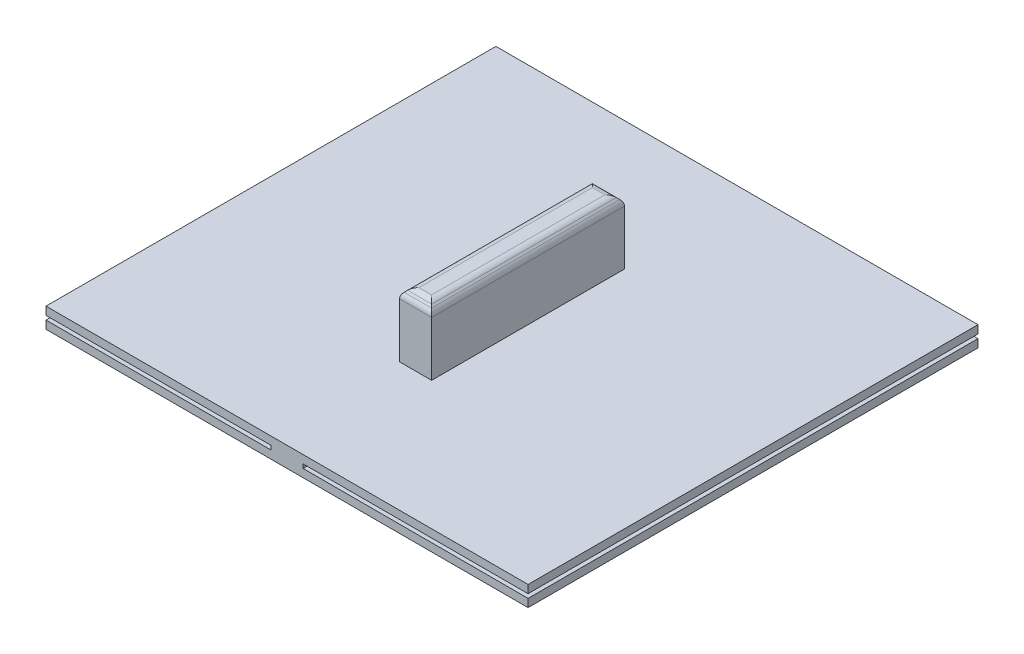
ISO-10303-21;
HEADER;
FILE_DESCRIPTION(('STEP AP214'),'2;1');
FILE_NAME('part.step','',(''),(''),'','','');
FILE_SCHEMA(('AUTOMOTIVE_DESIGN { 1 0 10303 214 1 1 1 1 }'));
ENDSEC;
DATA;
#1=APPLICATION_CONTEXT('core data for automotive mechanical design processes');
#2=APPLICATION_PROTOCOL_DEFINITION('international standard','automotive_design',2000,#1);
#3=PRODUCT_CONTEXT('',#1,'mechanical');
#4=PRODUCT('Part','Part','',(#3));
#5=PRODUCT_RELATED_PRODUCT_CATEGORY('part','',(#4));
#6=PRODUCT_DEFINITION_FORMATION('','',#4);
#7=PRODUCT_DEFINITION_CONTEXT('part definition',#1,'design');
#8=PRODUCT_DEFINITION('design','',#6,#7);
#9=PRODUCT_DEFINITION_SHAPE('','',#8);
#10=(LENGTH_UNIT() NAMED_UNIT(*) SI_UNIT(.MILLI.,.METRE.));
#11=(NAMED_UNIT(*) PLANE_ANGLE_UNIT() SI_UNIT($,.RADIAN.));
#12=(NAMED_UNIT(*) SI_UNIT($,.STERADIAN.) SOLID_ANGLE_UNIT());
#13=UNCERTAINTY_MEASURE_WITH_UNIT(LENGTH_MEASURE(1.E-05),#10,'distance_accuracy_value','');
#14=(GEOMETRIC_REPRESENTATION_CONTEXT(3) GLOBAL_UNCERTAINTY_ASSIGNED_CONTEXT((#13)) GLOBAL_UNIT_ASSIGNED_CONTEXT((#10,
#11,#12)) REPRESENTATION_CONTEXT('',''));
#15=CARTESIAN_POINT('',(0.,0.,0.));
#16=DIRECTION('',(0.,0.,1.));
#17=DIRECTION('',(1.,0.,0.));
#18=AXIS2_PLACEMENT_3D('',#15,#16,#17);
#19=CARTESIAN_POINT('',(-1.27,5.3975,-35.56));
#20=DIRECTION('',(-1.,0.,0.));
#21=DIRECTION('',(0.,-1.,0.));
#22=AXIS2_PLACEMENT_3D('',#19,#20,#21);
#23=PLANE('',#22);
#24=DIRECTION('',(0.,-1.,0.));
#25=VECTOR('',#24,1.);
#26=CARTESIAN_POINT('',(-1.27,5.3975,-10.16));
#27=LINE('',#26,#25);
#28=CARTESIAN_POINT('',(-1.27,4.62647438789308,-10.16));
#29=VERTEX_POINT('',#28);
#30=CARTESIAN_POINT('',(-1.27,0.3175,-10.16));
#31=VERTEX_POINT('',#30);
#32=EDGE_CURVE('E525',#29,#31,#27,.T.);
#33=ORIENTED_EDGE('',*,*,#32,.F.);
#34=DIRECTION('',(0.,0.,1.));
#35=VECTOR('',#34,1.);
#36=CARTESIAN_POINT('',(-1.27,4.62647438789308,-35.56));
#37=LINE('',#36,#35);
#38=CARTESIAN_POINT('',(-1.27,4.62647438789308,-25.4));
#39=VERTEX_POINT('',#38);
#40=EDGE_CURVE('E42',#29,#39,#37,.F.);
#41=ORIENTED_EDGE('',*,*,#40,.T.);
#42=DIRECTION('',(0.,1.,0.));
#43=VECTOR('',#42,1.);
#44=CARTESIAN_POINT('',(-1.27,0.3175,-25.4));
#45=LINE('',#44,#43);
#46=CARTESIAN_POINT('',(-1.27,0.3175,-25.4));
#47=VERTEX_POINT('',#46);
#48=EDGE_CURVE('E203',#47,#39,#45,.T.);
#49=ORIENTED_EDGE('',*,*,#48,.F.);
#50=DIRECTION('',(0.,0.,1.));
#51=VECTOR('',#50,1.);
#52=CARTESIAN_POINT('',(-1.27,0.3175,-35.56));
#53=LINE('',#52,#51);
#54=EDGE_CURVE('E202',#47,#31,#53,.T.);
#55=ORIENTED_EDGE('',*,*,#54,.T.);
#56=EDGE_LOOP('',(#33,#41,#49,#55));
#57=FACE_BOUND('',#56,.T.);
#58=ADVANCED_FACE('F33',(#57),#23,.T.);
#59=CARTESIAN_POINT('',(-1.27,5.3975,-35.56));
#60=DIRECTION('',(0.,1.,0.));
#61=DIRECTION('',(0.,0.,1.));
#62=AXIS2_PLACEMENT_3D('',#59,#60,#61);
#63=PLANE('',#62);
#64=DIRECTION('',(-1.,0.,0.));
#65=VECTOR('',#64,1.);
#66=CARTESIAN_POINT('',(-1.27,5.3975,-24.6289743878931));
#67=LINE('',#66,#65);
#68=CARTESIAN_POINT('',(0.49897438789308,5.3975,-24.6289743878931));
#69=VERTEX_POINT('',#68);
#70=CARTESIAN_POINT('',(-0.498974387893082,5.3975,-24.6289743878931));
#71=VERTEX_POINT('',#70);
#72=EDGE_CURVE('E233',#69,#71,#67,.T.);
#73=ORIENTED_EDGE('',*,*,#72,.T.);
#74=DIRECTION('',(0.,0.,-1.));
#75=VECTOR('',#74,1.);
#76=CARTESIAN_POINT('',(-0.498974387893082,5.3975,-35.56));
#77=LINE('',#76,#75);
#78=CARTESIAN_POINT('',(-0.498974387893082,5.3975,-10.9310256121069));
#79=VERTEX_POINT('',#78);
#80=EDGE_CURVE('E235',#71,#79,#77,.F.);
#81=ORIENTED_EDGE('',*,*,#80,.T.);
#82=DIRECTION('',(-1.,0.,0.));
#83=VECTOR('',#82,1.);
#84=CARTESIAN_POINT('',(-1.27,5.3975,-10.9310256121069));
#85=LINE('',#84,#83);
#86=CARTESIAN_POINT('',(0.49897438789308,5.3975,-10.9310256121069));
#87=VERTEX_POINT('',#86);
#88=EDGE_CURVE('E228',#79,#87,#85,.F.);
#89=ORIENTED_EDGE('',*,*,#88,.T.);
#90=DIRECTION('',(0.,0.,1.));
#91=VECTOR('',#90,1.);
#92=CARTESIAN_POINT('',(0.49897438789308,5.3975,-35.56));
#93=LINE('',#92,#91);
#94=EDGE_CURVE('E230',#87,#69,#93,.F.);
#95=ORIENTED_EDGE('',*,*,#94,.T.);
#96=EDGE_LOOP('',(#73,#81,#89,#95));
#97=FACE_BOUND('',#96,.T.);
#98=ADVANCED_FACE('F306',(#97),#63,.T.);
#99=CARTESIAN_POINT('',(1.27,0.3175,-35.56));
#100=DIRECTION('',(1.,0.,0.));
#101=DIRECTION('',(0.,1.,0.));
#102=AXIS2_PLACEMENT_3D('',#99,#100,#101);
#103=PLANE('',#102);
#104=DIRECTION('',(0.,-1.,0.));
#105=VECTOR('',#104,1.);
#106=CARTESIAN_POINT('',(1.27,0.3175,-25.4));
#107=LINE('',#106,#105);
#108=CARTESIAN_POINT('',(1.27,4.62647438789308,-25.4));
#109=VERTEX_POINT('',#108);
#110=CARTESIAN_POINT('',(1.27,0.3175,-25.4));
#111=VERTEX_POINT('',#110);
#112=EDGE_CURVE('E183',#109,#111,#107,.T.);
#113=ORIENTED_EDGE('',*,*,#112,.F.);
#114=DIRECTION('',(0.,0.,-1.));
#115=VECTOR('',#114,1.);
#116=CARTESIAN_POINT('',(1.27,4.62647438789308,-35.56));
#117=LINE('',#116,#115);
#118=CARTESIAN_POINT('',(1.27,4.62647438789308,-10.16));
#119=VERTEX_POINT('',#118);
#120=EDGE_CURVE('E11',#109,#119,#117,.F.);
#121=ORIENTED_EDGE('',*,*,#120,.T.);
#122=DIRECTION('',(0.,1.,0.));
#123=VECTOR('',#122,1.);
#124=CARTESIAN_POINT('',(1.27,5.3975,-10.16));
#125=LINE('',#124,#123);
#126=CARTESIAN_POINT('',(1.27,0.3175,-10.16));
#127=VERTEX_POINT('',#126);
#128=EDGE_CURVE('E206',#127,#119,#125,.T.);
#129=ORIENTED_EDGE('',*,*,#128,.F.);
#130=DIRECTION('',(0.,0.,1.));
#131=VECTOR('',#130,1.);
#132=CARTESIAN_POINT('',(1.27,0.3175,-35.56));
#133=LINE('',#132,#131);
#134=EDGE_CURVE('E199',#111,#127,#133,.T.);
#135=ORIENTED_EDGE('',*,*,#134,.F.);
#136=EDGE_LOOP('',(#113,#121,#129,#135));
#137=FACE_BOUND('',#136,.T.);
#138=ADVANCED_FACE('F205',(#137),#103,.T.);
#139=CARTESIAN_POINT('',(19.05,-0.3175,-35.56));
#140=DIRECTION('',(1.,0.,0.));
#141=DIRECTION('',(0.,0.,-1.));
#142=AXIS2_PLACEMENT_3D('',#139,#140,#141);
#143=PLANE('',#142);
#144=DIRECTION('',(0.,1.,0.));
#145=VECTOR('',#144,1.);
#146=CARTESIAN_POINT('',(19.05,-0.3175,0.));
#147=LINE('',#146,#145);
#148=CARTESIAN_POINT('',(19.05,-0.3175,0.));
#149=VERTEX_POINT('',#148);
#150=CARTESIAN_POINT('',(19.05,0.3175,0.));
#151=VERTEX_POINT('',#150);
#152=EDGE_CURVE('E424',#149,#151,#147,.T.);
#153=ORIENTED_EDGE('',*,*,#152,.F.);
#154=DIRECTION('',(0.,0.,1.));
#155=VECTOR('',#154,1.);
#156=CARTESIAN_POINT('',(19.05,-0.3175,-35.56));
#157=LINE('',#156,#155);
#158=CARTESIAN_POINT('',(19.05,-0.3175,-35.56));
#159=VERTEX_POINT('',#158);
#160=EDGE_CURVE('E458',#159,#149,#157,.T.);
#161=ORIENTED_EDGE('',*,*,#160,.F.);
#162=DIRECTION('',(0.,1.,0.));
#163=VECTOR('',#162,1.);
#164=CARTESIAN_POINT('',(19.05,-0.3175,-35.56));
#165=LINE('',#164,#163);
#166=CARTESIAN_POINT('',(19.05,0.3175,-35.56));
#167=VERTEX_POINT('',#166);
#168=EDGE_CURVE('E207',#159,#167,#165,.T.);
#169=ORIENTED_EDGE('',*,*,#168,.T.);
#170=DIRECTION('',(0.,0.,1.));
#171=VECTOR('',#170,1.);
#172=CARTESIAN_POINT('',(19.05,0.3175,-35.56));
#173=LINE('',#172,#171);
#174=EDGE_CURVE('E231',#167,#151,#173,.T.);
#175=ORIENTED_EDGE('',*,*,#174,.T.);
#176=EDGE_LOOP('',(#153,#161,#169,#175));
#177=FACE_BOUND('',#176,.T.);
#178=ADVANCED_FACE('F337',(#177),#143,.T.);
#179=CARTESIAN_POINT('',(1.27,-0.3175,-35.56));
#180=DIRECTION('',(0.,-1.,0.));
#181=DIRECTION('',(0.,0.,-1.));
#182=AXIS2_PLACEMENT_3D('',#179,#180,#181);
#183=PLANE('',#182);
#184=DIRECTION('',(1.,0.,0.));
#185=VECTOR('',#184,1.);
#186=CARTESIAN_POINT('',(1.27,-0.3175,0.));
#187=LINE('',#186,#185);
#188=CARTESIAN_POINT('',(1.27,-0.3175,0.));
#189=VERTEX_POINT('',#188);
#190=EDGE_CURVE('E453',#189,#149,#187,.T.);
#191=ORIENTED_EDGE('',*,*,#190,.F.);
#192=DIRECTION('',(0.,0.,1.));
#193=VECTOR('',#192,1.);
#194=CARTESIAN_POINT('',(1.27,-0.3175,-35.56));
#195=LINE('',#194,#193);
#196=CARTESIAN_POINT('',(1.27,-0.3175,-35.56));
#197=VERTEX_POINT('',#196);
#198=EDGE_CURVE('E460',#197,#189,#195,.T.);
#199=ORIENTED_EDGE('',*,*,#198,.F.);
#200=DIRECTION('',(1.,0.,0.));
#201=VECTOR('',#200,1.);
#202=CARTESIAN_POINT('',(1.27,-0.3175,-35.56));
#203=LINE('',#202,#201);
#204=EDGE_CURVE('E212',#197,#159,#203,.T.);
#205=ORIENTED_EDGE('',*,*,#204,.T.);
#206=ORIENTED_EDGE('',*,*,#160,.T.);
#207=EDGE_LOOP('',(#191,#199,#205,#206));
#208=FACE_BOUND('',#207,.T.);
#209=ADVANCED_FACE('F366',(#208),#183,.T.);
#210=CARTESIAN_POINT('',(1.27,-0.635,-35.56));
#211=DIRECTION('',(1.,0.,0.));
#212=DIRECTION('',(0.,1.,0.));
#213=AXIS2_PLACEMENT_3D('',#210,#211,#212);
#214=PLANE('',#213);
#215=DIRECTION('',(0.,1.,0.));
#216=VECTOR('',#215,1.);
#217=CARTESIAN_POINT('',(1.27,-0.635,0.));
#218=LINE('',#217,#216);
#219=CARTESIAN_POINT('',(1.27,-0.635,0.));
#220=VERTEX_POINT('',#219);
#221=EDGE_CURVE('E450',#220,#189,#218,.T.);
#222=ORIENTED_EDGE('',*,*,#221,.F.);
#223=DIRECTION('',(0.,0.,1.));
#224=VECTOR('',#223,1.);
#225=CARTESIAN_POINT('',(1.27,-0.635,-35.56));
#226=LINE('',#225,#224);
#227=CARTESIAN_POINT('',(1.27,-0.635,-35.56));
#228=VERTEX_POINT('',#227);
#229=EDGE_CURVE('E462',#228,#220,#226,.T.);
#230=ORIENTED_EDGE('',*,*,#229,.F.);
#231=DIRECTION('',(0.,1.,0.));
#232=VECTOR('',#231,1.);
#233=CARTESIAN_POINT('',(1.27,-0.635,-35.56));
#234=LINE('',#233,#232);
#235=EDGE_CURVE('E504',#228,#197,#234,.T.);
#236=ORIENTED_EDGE('',*,*,#235,.T.);
#237=ORIENTED_EDGE('',*,*,#198,.T.);
#238=EDGE_LOOP('',(#222,#230,#236,#237));
#239=FACE_BOUND('',#238,.T.);
#240=ADVANCED_FACE('F370',(#239),#214,.T.);
#241=CARTESIAN_POINT('',(1.27,-0.635,-35.56));
#242=DIRECTION('',(0.,1.,0.));
#243=DIRECTION('',(0.,0.,1.));
#244=AXIS2_PLACEMENT_3D('',#241,#242,#243);
#245=PLANE('',#244);
#246=DIRECTION('',(-1.,0.,0.));
#247=VECTOR('',#246,1.);
#248=CARTESIAN_POINT('',(1.27,-0.635,0.));
#249=LINE('',#248,#247);
#250=CARTESIAN_POINT('',(19.05,-0.635,0.));
#251=VERTEX_POINT('',#250);
#252=EDGE_CURVE('E447',#251,#220,#249,.T.);
#253=ORIENTED_EDGE('',*,*,#252,.F.);
#254=DIRECTION('',(0.,0.,1.));
#255=VECTOR('',#254,1.);
#256=CARTESIAN_POINT('',(19.05,-0.635,-35.56));
#257=LINE('',#256,#255);
#258=CARTESIAN_POINT('',(19.05,-0.635,-35.56));
#259=VERTEX_POINT('',#258);
#260=EDGE_CURVE('E464',#259,#251,#257,.T.);
#261=ORIENTED_EDGE('',*,*,#260,.F.);
#262=DIRECTION('',(-1.,0.,0.));
#263=VECTOR('',#262,1.);
#264=CARTESIAN_POINT('',(1.27,-0.635,-35.56));
#265=LINE('',#264,#263);
#266=EDGE_CURVE('E501',#259,#228,#265,.T.);
#267=ORIENTED_EDGE('',*,*,#266,.T.);
#268=ORIENTED_EDGE('',*,*,#229,.T.);
#269=EDGE_LOOP('',(#253,#261,#267,#268));
#270=FACE_BOUND('',#269,.T.);
#271=ADVANCED_FACE('F374',(#270),#245,.T.);
#272=CARTESIAN_POINT('',(19.05,-1.27,-35.56));
#273=DIRECTION('',(1.,0.,0.));
#274=DIRECTION('',(0.,0.,-1.));
#275=AXIS2_PLACEMENT_3D('',#272,#273,#274);
#276=PLANE('',#275);
#277=DIRECTION('',(0.,1.,0.));
#278=VECTOR('',#277,1.);
#279=CARTESIAN_POINT('',(19.05,-1.27,0.));
#280=LINE('',#279,#278);
#281=CARTESIAN_POINT('',(19.05,-1.27,0.));
#282=VERTEX_POINT('',#281);
#283=EDGE_CURVE('E444',#282,#251,#280,.T.);
#284=ORIENTED_EDGE('',*,*,#283,.F.);
#285=DIRECTION('',(0.,0.,1.));
#286=VECTOR('',#285,1.);
#287=CARTESIAN_POINT('',(19.05,-1.27,-35.56));
#288=LINE('',#287,#286);
#289=CARTESIAN_POINT('',(19.05,-1.27,-35.56));
#290=VERTEX_POINT('',#289);
#291=EDGE_CURVE('E466',#290,#282,#288,.T.);
#292=ORIENTED_EDGE('',*,*,#291,.F.);
#293=DIRECTION('',(0.,1.,0.));
#294=VECTOR('',#293,1.);
#295=CARTESIAN_POINT('',(19.05,-1.27,-35.56));
#296=LINE('',#295,#294);
#297=EDGE_CURVE('E498',#290,#259,#296,.T.);
#298=ORIENTED_EDGE('',*,*,#297,.T.);
#299=ORIENTED_EDGE('',*,*,#260,.T.);
#300=EDGE_LOOP('',(#284,#292,#298,#299));
#301=FACE_BOUND('',#300,.T.);
#302=ADVANCED_FACE('F378',(#301),#276,.T.);
#303=CARTESIAN_POINT('',(-19.05,-1.27,-35.56));
#304=DIRECTION('',(0.,-1.,0.));
#305=DIRECTION('',(0.,0.,-1.));
#306=AXIS2_PLACEMENT_3D('',#303,#304,#305);
#307=PLANE('',#306);
#308=DIRECTION('',(1.,0.,0.));
#309=VECTOR('',#308,1.);
#310=CARTESIAN_POINT('',(-19.05,-1.27,0.));
#311=LINE('',#310,#309);
#312=CARTESIAN_POINT('',(-19.05,-1.27,0.));
#313=VERTEX_POINT('',#312);
#314=EDGE_CURVE('E441',#313,#282,#311,.T.);
#315=ORIENTED_EDGE('',*,*,#314,.F.);
#316=DIRECTION('',(0.,0.,1.));
#317=VECTOR('',#316,1.);
#318=CARTESIAN_POINT('',(-19.05,-1.27,-35.56));
#319=LINE('',#318,#317);
#320=CARTESIAN_POINT('',(-19.05,-1.27,-35.56));
#321=VERTEX_POINT('',#320);
#322=EDGE_CURVE('E468',#321,#313,#319,.T.);
#323=ORIENTED_EDGE('',*,*,#322,.F.);
#324=DIRECTION('',(1.,0.,0.));
#325=VECTOR('',#324,1.);
#326=CARTESIAN_POINT('',(-19.05,-1.27,-35.56));
#327=LINE('',#326,#325);
#328=EDGE_CURVE('E495',#321,#290,#327,.T.);
#329=ORIENTED_EDGE('',*,*,#328,.T.);
#330=ORIENTED_EDGE('',*,*,#291,.T.);
#331=EDGE_LOOP('',(#315,#323,#329,#330));
#332=FACE_BOUND('',#331,.T.);
#333=ADVANCED_FACE('F382',(#332),#307,.T.);
#334=CARTESIAN_POINT('',(-19.05,-1.27,-35.56));
#335=DIRECTION('',(-1.,0.,0.));
#336=DIRECTION('',(0.,0.,1.));
#337=AXIS2_PLACEMENT_3D('',#334,#335,#336);
#338=PLANE('',#337);
#339=DIRECTION('',(0.,-1.,0.));
#340=VECTOR('',#339,1.);
#341=CARTESIAN_POINT('',(-19.05,-1.27,0.));
#342=LINE('',#341,#340);
#343=CARTESIAN_POINT('',(-19.05,-0.635,0.));
#344=VERTEX_POINT('',#343);
#345=EDGE_CURVE('E438',#344,#313,#342,.T.);
#346=ORIENTED_EDGE('',*,*,#345,.F.);
#347=DIRECTION('',(0.,0.,1.));
#348=VECTOR('',#347,1.);
#349=CARTESIAN_POINT('',(-19.05,-0.635,-35.56));
#350=LINE('',#349,#348);
#351=CARTESIAN_POINT('',(-19.05,-0.635,-35.56));
#352=VERTEX_POINT('',#351);
#353=EDGE_CURVE('E470',#352,#344,#350,.T.);
#354=ORIENTED_EDGE('',*,*,#353,.F.);
#355=DIRECTION('',(0.,-1.,0.));
#356=VECTOR('',#355,1.);
#357=CARTESIAN_POINT('',(-19.05,-1.27,-35.56));
#358=LINE('',#357,#356);
#359=EDGE_CURVE('E492',#352,#321,#358,.T.);
#360=ORIENTED_EDGE('',*,*,#359,.T.);
#361=ORIENTED_EDGE('',*,*,#322,.T.);
#362=EDGE_LOOP('',(#346,#354,#360,#361));
#363=FACE_BOUND('',#362,.T.);
#364=ADVANCED_FACE('F386',(#363),#338,.T.);
#365=CARTESIAN_POINT('',(-19.05,-0.635,-35.56));
#366=DIRECTION('',(0.,1.,0.));
#367=DIRECTION('',(0.,0.,1.));
#368=AXIS2_PLACEMENT_3D('',#365,#366,#367);
#369=PLANE('',#368);
#370=DIRECTION('',(-1.,0.,0.));
#371=VECTOR('',#370,1.);
#372=CARTESIAN_POINT('',(-19.05,-0.635,0.));
#373=LINE('',#372,#371);
#374=CARTESIAN_POINT('',(-1.27,-0.635,0.));
#375=VERTEX_POINT('',#374);
#376=EDGE_CURVE('E435',#375,#344,#373,.T.);
#377=ORIENTED_EDGE('',*,*,#376,.F.);
#378=DIRECTION('',(0.,0.,1.));
#379=VECTOR('',#378,1.);
#380=CARTESIAN_POINT('',(-1.27,-0.635,-35.56));
#381=LINE('',#380,#379);
#382=CARTESIAN_POINT('',(-1.27,-0.635,-35.56));
#383=VERTEX_POINT('',#382);
#384=EDGE_CURVE('E472',#383,#375,#381,.T.);
#385=ORIENTED_EDGE('',*,*,#384,.F.);
#386=DIRECTION('',(-1.,0.,0.));
#387=VECTOR('',#386,1.);
#388=CARTESIAN_POINT('',(-19.05,-0.635,-35.56));
#389=LINE('',#388,#387);
#390=EDGE_CURVE('E489',#383,#352,#389,.T.);
#391=ORIENTED_EDGE('',*,*,#390,.T.);
#392=ORIENTED_EDGE('',*,*,#353,.T.);
#393=EDGE_LOOP('',(#377,#385,#391,#392));
#394=FACE_BOUND('',#393,.T.);
#395=ADVANCED_FACE('F390',(#394),#369,.T.);
#396=CARTESIAN_POINT('',(-1.27,-0.635,-35.56));
#397=DIRECTION('',(-1.,0.,0.));
#398=DIRECTION('',(0.,-1.,0.));
#399=AXIS2_PLACEMENT_3D('',#396,#397,#398);
#400=PLANE('',#399);
#401=DIRECTION('',(0.,-1.,0.));
#402=VECTOR('',#401,1.);
#403=CARTESIAN_POINT('',(-1.27,-0.635,0.));
#404=LINE('',#403,#402);
#405=CARTESIAN_POINT('',(-1.27,-0.3175,0.));
#406=VERTEX_POINT('',#405);
#407=EDGE_CURVE('E432',#406,#375,#404,.T.);
#408=ORIENTED_EDGE('',*,*,#407,.F.);
#409=DIRECTION('',(0.,0.,1.));
#410=VECTOR('',#409,1.);
#411=CARTESIAN_POINT('',(-1.27,-0.3175,-35.56));
#412=LINE('',#411,#410);
#413=CARTESIAN_POINT('',(-1.27,-0.3175,-35.56));
#414=VERTEX_POINT('',#413);
#415=EDGE_CURVE('E474',#414,#406,#412,.T.);
#416=ORIENTED_EDGE('',*,*,#415,.F.);
#417=DIRECTION('',(0.,-1.,0.));
#418=VECTOR('',#417,1.);
#419=CARTESIAN_POINT('',(-1.27,-0.635,-35.56));
#420=LINE('',#419,#418);
#421=EDGE_CURVE('E486',#414,#383,#420,.T.);
#422=ORIENTED_EDGE('',*,*,#421,.T.);
#423=ORIENTED_EDGE('',*,*,#384,.T.);
#424=EDGE_LOOP('',(#408,#416,#422,#423));
#425=FACE_BOUND('',#424,.T.);
#426=ADVANCED_FACE('F394',(#425),#400,.T.);
#427=CARTESIAN_POINT('',(-1.27,-0.3175,-35.56));
#428=DIRECTION('',(0.,-1.,0.));
#429=DIRECTION('',(0.,0.,-1.));
#430=AXIS2_PLACEMENT_3D('',#427,#428,#429);
#431=PLANE('',#430);
#432=DIRECTION('',(1.,0.,0.));
#433=VECTOR('',#432,1.);
#434=CARTESIAN_POINT('',(-1.27,-0.3175,0.));
#435=LINE('',#434,#433);
#436=CARTESIAN_POINT('',(-19.05,-0.3175,0.));
#437=VERTEX_POINT('',#436);
#438=EDGE_CURVE('E418',#437,#406,#435,.T.);
#439=ORIENTED_EDGE('',*,*,#438,.F.);
#440=DIRECTION('',(0.,0.,1.));
#441=VECTOR('',#440,1.);
#442=CARTESIAN_POINT('',(-19.05,-0.3175,-35.56));
#443=LINE('',#442,#441);
#444=CARTESIAN_POINT('',(-19.05,-0.3175,-35.56));
#445=VERTEX_POINT('',#444);
#446=EDGE_CURVE('E415',#445,#437,#443,.T.);
#447=ORIENTED_EDGE('',*,*,#446,.F.);
#448=DIRECTION('',(1.,0.,0.));
#449=VECTOR('',#448,1.);
#450=CARTESIAN_POINT('',(-1.27,-0.3175,-35.56));
#451=LINE('',#450,#449);
#452=EDGE_CURVE('E480',#445,#414,#451,.T.);
#453=ORIENTED_EDGE('',*,*,#452,.T.);
#454=ORIENTED_EDGE('',*,*,#415,.T.);
#455=EDGE_LOOP('',(#439,#447,#453,#454));
#456=FACE_BOUND('',#455,.T.);
#457=ADVANCED_FACE('F398',(#456),#431,.T.);
#458=CARTESIAN_POINT('',(-19.05,-0.3175,-35.56));
#459=DIRECTION('',(-1.,0.,0.));
#460=DIRECTION('',(0.,0.,1.));
#461=AXIS2_PLACEMENT_3D('',#458,#459,#460);
#462=PLANE('',#461);
#463=DIRECTION('',(0.,-1.,0.));
#464=VECTOR('',#463,1.);
#465=CARTESIAN_POINT('',(-19.05,-0.3175,0.));
#466=LINE('',#465,#464);
#467=CARTESIAN_POINT('',(-19.05,0.3175,0.));
#468=VERTEX_POINT('',#467);
#469=EDGE_CURVE('E411',#468,#437,#466,.T.);
#470=ORIENTED_EDGE('',*,*,#469,.F.);
#471=DIRECTION('',(0.,0.,1.));
#472=VECTOR('',#471,1.);
#473=CARTESIAN_POINT('',(-19.05,0.3175,-35.56));
#474=LINE('',#473,#472);
#475=CARTESIAN_POINT('',(-19.05,0.3175,-35.56));
#476=VERTEX_POINT('',#475);
#477=EDGE_CURVE('E209',#476,#468,#474,.T.);
#478=ORIENTED_EDGE('',*,*,#477,.F.);
#479=DIRECTION('',(0.,-1.,0.));
#480=VECTOR('',#479,1.);
#481=CARTESIAN_POINT('',(-19.05,-0.3175,-35.56));
#482=LINE('',#481,#480);
#483=EDGE_CURVE('E478',#476,#445,#482,.T.);
#484=ORIENTED_EDGE('',*,*,#483,.T.);
#485=ORIENTED_EDGE('',*,*,#446,.T.);
#486=EDGE_LOOP('',(#470,#478,#484,#485));
#487=FACE_BOUND('',#486,.T.);
#488=ADVANCED_FACE('F401',(#487),#462,.T.);
#489=CARTESIAN_POINT('',(-1.27,0.3175,-35.56));
#490=DIRECTION('',(0.,1.,0.));
#491=DIRECTION('',(0.,0.,1.));
#492=AXIS2_PLACEMENT_3D('',#489,#490,#491);
#493=PLANE('',#492);
#494=DIRECTION('',(-1.,0.,0.));
#495=VECTOR('',#494,1.);
#496=CARTESIAN_POINT('',(1.27,0.3175,-25.4));
#497=LINE('',#496,#495);
#498=EDGE_CURVE('E187',#111,#47,#497,.T.);
#499=ORIENTED_EDGE('',*,*,#498,.F.);
#500=ORIENTED_EDGE('',*,*,#134,.T.);
#501=DIRECTION('',(1.,0.,0.));
#502=VECTOR('',#501,1.);
#503=CARTESIAN_POINT('',(-1.27,0.3175,-10.16));
#504=LINE('',#503,#502);
#505=EDGE_CURVE('E427',#31,#127,#504,.T.);
#506=ORIENTED_EDGE('',*,*,#505,.F.);
#507=ORIENTED_EDGE('',*,*,#54,.F.);
#508=EDGE_LOOP('',(#499,#500,#506,#507));
#509=FACE_BOUND('',#508,.T.);
#510=DIRECTION('',(-1.,0.,0.));
#511=VECTOR('',#510,1.);
#512=CARTESIAN_POINT('',(-1.27,0.3175,0.));
#513=LINE('',#512,#511);
#514=EDGE_CURVE('E419',#151,#468,#513,.T.);
#515=ORIENTED_EDGE('',*,*,#514,.F.);
#516=ORIENTED_EDGE('',*,*,#174,.F.);
#517=DIRECTION('',(-1.,0.,0.));
#518=VECTOR('',#517,1.);
#519=CARTESIAN_POINT('',(19.05,0.3175,-35.56));
#520=LINE('',#519,#518);
#521=EDGE_CURVE('E456',#167,#476,#520,.T.);
#522=ORIENTED_EDGE('',*,*,#521,.T.);
#523=ORIENTED_EDGE('',*,*,#477,.T.);
#524=EDGE_LOOP('',(#515,#516,#522,#523));
#525=FACE_BOUND('',#524,.T.);
#526=ADVANCED_FACE('F196',(#509,#525),#493,.T.);
#527=CARTESIAN_POINT('',(0.,0.,-35.56));
#528=DIRECTION('',(0.,0.,-1.));
#529=DIRECTION('',(-1.,0.,0.));
#530=AXIS2_PLACEMENT_3D('',#527,#528,#529);
#531=PLANE('',#530);
#532=ORIENTED_EDGE('',*,*,#483,.F.);
#533=ORIENTED_EDGE('',*,*,#521,.F.);
#534=ORIENTED_EDGE('',*,*,#168,.F.);
#535=ORIENTED_EDGE('',*,*,#204,.F.);
#536=ORIENTED_EDGE('',*,*,#235,.F.);
#537=ORIENTED_EDGE('',*,*,#266,.F.);
#538=ORIENTED_EDGE('',*,*,#297,.F.);
#539=ORIENTED_EDGE('',*,*,#328,.F.);
#540=ORIENTED_EDGE('',*,*,#359,.F.);
#541=ORIENTED_EDGE('',*,*,#390,.F.);
#542=ORIENTED_EDGE('',*,*,#421,.F.);
#543=ORIENTED_EDGE('',*,*,#452,.F.);
#544=EDGE_LOOP('',(#532,#533,#534,#535,#536,#537,#538,#539,#540,#541,#542,#543));
#545=FACE_BOUND('',#544,.T.);
#546=ADVANCED_FACE('F357',(#545),#531,.T.);
#547=CARTESIAN_POINT('',(0.,0.,0.));
#548=DIRECTION('',(0.,0.,-1.));
#549=DIRECTION('',(-1.,0.,0.));
#550=AXIS2_PLACEMENT_3D('',#547,#548,#549);
#551=PLANE('',#550);
#552=ORIENTED_EDGE('',*,*,#152,.T.);
#553=ORIENTED_EDGE('',*,*,#514,.T.);
#554=ORIENTED_EDGE('',*,*,#469,.T.);
#555=ORIENTED_EDGE('',*,*,#438,.T.);
#556=ORIENTED_EDGE('',*,*,#407,.T.);
#557=ORIENTED_EDGE('',*,*,#376,.T.);
#558=ORIENTED_EDGE('',*,*,#345,.T.);
#559=ORIENTED_EDGE('',*,*,#314,.T.);
#560=ORIENTED_EDGE('',*,*,#283,.T.);
#561=ORIENTED_EDGE('',*,*,#252,.T.);
#562=ORIENTED_EDGE('',*,*,#221,.T.);
#563=ORIENTED_EDGE('',*,*,#190,.T.);
#564=EDGE_LOOP('',(#552,#553,#554,#555,#556,#557,#558,#559,#560,#561,#562,#563));
#565=FACE_BOUND('',#564,.T.);
#566=ADVANCED_FACE('F354',(#565),#551,.F.);
#567=CARTESIAN_POINT('',(0.,0.,-10.16));
#568=DIRECTION('',(0.,0.,1.));
#569=DIRECTION('',(1.,0.,0.));
#570=AXIS2_PLACEMENT_3D('',#567,#568,#569);
#571=PLANE('',#570);
#572=ORIENTED_EDGE('',*,*,#128,.T.);
#573=DIRECTION('',(1.,0.,0.));
#574=VECTOR('',#573,1.);
#575=CARTESIAN_POINT('',(0.,4.62647438789308,-10.16));
#576=LINE('',#575,#574);
#577=EDGE_CURVE('E50',#119,#29,#576,.F.);
#578=ORIENTED_EDGE('',*,*,#577,.T.);
#579=ORIENTED_EDGE('',*,*,#32,.T.);
#580=ORIENTED_EDGE('',*,*,#505,.T.);
#581=EDGE_LOOP('',(#572,#578,#579,#580));
#582=FACE_BOUND('',#581,.T.);
#583=ADVANCED_FACE('F349',(#582),#571,.T.);
#584=CARTESIAN_POINT('',(0.,0.,-25.4));
#585=DIRECTION('',(0.,0.,1.));
#586=DIRECTION('',(1.,0.,0.));
#587=AXIS2_PLACEMENT_3D('',#584,#585,#586);
#588=PLANE('',#587);
#589=ORIENTED_EDGE('',*,*,#48,.T.);
#590=DIRECTION('',(1.,0.,0.));
#591=VECTOR('',#590,1.);
#592=CARTESIAN_POINT('',(1.27,4.62647438789308,-25.4));
#593=LINE('',#592,#591);
#594=EDGE_CURVE('E190',#39,#109,#593,.T.);
#595=ORIENTED_EDGE('',*,*,#594,.T.);
#596=ORIENTED_EDGE('',*,*,#112,.T.);
#597=ORIENTED_EDGE('',*,*,#498,.T.);
#598=EDGE_LOOP('',(#589,#595,#596,#597));
#599=FACE_BOUND('',#598,.T.);
#600=ADVANCED_FACE('F186',(#599),#588,.F.);
#601=CARTESIAN_POINT('',(-0.761999999999999,5.3975,-35.56));
#602=DIRECTION('',(0.707106781186553,-0.707106781186542,0.));
#603=DIRECTION('',(0.,0.,1.));
#604=AXIS2_PLACEMENT_3D('',#601,#602,#603);
#605=PLANE('',#604);
#606=DIRECTION('',(0.577350269189622,0.577350269189631,-0.577350269189625));
#607=VECTOR('',#606,1.);
#608=CARTESIAN_POINT('',(7.53533333333326,13.6948333333334,-18.9653333333333));
#609=LINE('',#608,#607);
#610=CARTESIAN_POINT('',(-0.947987193946541,5.21151280605346,-10.4820128060535));
#611=VERTEX_POINT('',#610);
#612=CARTESIAN_POINT('',(-1.08401280605346,5.07548719394653,-10.3459871939465));
#613=VERTEX_POINT('',#612);
#614=EDGE_CURVE('E223',#611,#613,#609,.F.);
#615=ORIENTED_EDGE('',*,*,#614,.F.);
#616=DIRECTION('',(0.,0.,1.));
#617=VECTOR('',#616,1.);
#618=CARTESIAN_POINT('',(-0.947987193946542,5.21151280605346,-35.56));
#619=LINE('',#618,#617);
#620=CARTESIAN_POINT('',(-0.947987193946542,5.21151280605346,-25.0779871939465));
#621=VERTEX_POINT('',#620);
#622=EDGE_CURVE('E240',#611,#621,#619,.F.);
#623=ORIENTED_EDGE('',*,*,#622,.T.);
#624=DIRECTION('',(-0.577350269189623,-0.577350269189631,-0.577350269189623));
#625=VECTOR('',#624,1.);
#626=CARTESIAN_POINT('',(-0.846666666666671,5.31283333333333,-24.9766666666667));
#627=LINE('',#626,#625);
#628=CARTESIAN_POINT('',(-1.08401280605346,5.07548719394653,-25.2140128060535));
#629=VERTEX_POINT('',#628);
#630=EDGE_CURVE('E192',#629,#621,#627,.F.);
#631=ORIENTED_EDGE('',*,*,#630,.F.);
#632=DIRECTION('',(0.,0.,-1.));
#633=VECTOR('',#632,1.);
#634=CARTESIAN_POINT('',(-1.08401280605346,5.07548719394653,-35.56));
#635=LINE('',#634,#633);
#636=EDGE_CURVE('E238',#629,#613,#635,.F.);
#637=ORIENTED_EDGE('',*,*,#636,.T.);
#638=EDGE_LOOP('',(#615,#623,#631,#637));
#639=FACE_BOUND('',#638,.T.);
#640=ADVANCED_FACE('F313',(#639),#605,.F.);
#641=CARTESIAN_POINT('',(0.,4.88949999999999,-25.4));
#642=DIRECTION('',(0.,0.707106781186543,-0.707106781186552));
#643=DIRECTION('',(-1.,0.,0.));
#644=AXIS2_PLACEMENT_3D('',#641,#642,#643);
#645=PLANE('',#644);
#646=ORIENTED_EDGE('',*,*,#630,.T.);
#647=DIRECTION('',(-1.,0.,0.));
#648=VECTOR('',#647,1.);
#649=CARTESIAN_POINT('',(0.,5.21151280605346,-25.0779871939465));
#650=LINE('',#649,#648);
#651=CARTESIAN_POINT('',(0.947987193946541,5.21151280605346,-25.0779871939465));
#652=VERTEX_POINT('',#651);
#653=EDGE_CURVE('E246',#621,#652,#650,.F.);
#654=ORIENTED_EDGE('',*,*,#653,.T.);
#655=DIRECTION('',(-0.577350269189623,0.577350269189631,0.577350269189623));
#656=VECTOR('',#655,1.);
#657=CARTESIAN_POINT('',(0.84666666666667,5.31283333333333,-24.9766666666667));
#658=LINE('',#657,#656);
#659=CARTESIAN_POINT('',(1.08401280605346,5.07548719394653,-25.2140128060535));
#660=VERTEX_POINT('',#659);
#661=EDGE_CURVE('E219',#660,#652,#658,.T.);
#662=ORIENTED_EDGE('',*,*,#661,.F.);
#663=DIRECTION('',(1.,0.,0.));
#664=VECTOR('',#663,1.);
#665=CARTESIAN_POINT('',(-1.27,5.07548719394653,-25.2140128060535));
#666=LINE('',#665,#664);
#667=EDGE_CURVE('E243',#660,#629,#666,.F.);
#668=ORIENTED_EDGE('',*,*,#667,.T.);
#669=EDGE_LOOP('',(#646,#654,#662,#668));
#670=FACE_BOUND('',#669,.T.);
#671=ADVANCED_FACE('F342',(#670),#645,.T.);
#672=CARTESIAN_POINT('',(0.,4.88949999999999,-10.16));
#673=DIRECTION('',(0.,-0.707106781186544,-0.707106781186551));
#674=DIRECTION('',(-1.,0.,0.));
#675=AXIS2_PLACEMENT_3D('',#672,#673,#674);
#676=PLANE('',#675);
#677=DIRECTION('',(-0.577350269189622,0.577350269189631,-0.577350269189625));
#678=VECTOR('',#677,1.);
#679=CARTESIAN_POINT('',(0.846666666666671,5.31283333333333,-10.5833333333333));
#680=LINE('',#679,#678);
#681=CARTESIAN_POINT('',(0.947987193946539,5.21151280605346,-10.4820128060535));
#682=VERTEX_POINT('',#681);
#683=CARTESIAN_POINT('',(1.08401280605346,5.07548719394653,-10.3459871939465));
#684=VERTEX_POINT('',#683);
#685=EDGE_CURVE('E216',#682,#684,#680,.F.);
#686=ORIENTED_EDGE('',*,*,#685,.F.);
#687=DIRECTION('',(1.,0.,0.));
#688=VECTOR('',#687,1.);
#689=CARTESIAN_POINT('',(0.,5.21151280605346,-10.4820128060535));
#690=LINE('',#689,#688);
#691=EDGE_CURVE('E254',#682,#611,#690,.F.);
#692=ORIENTED_EDGE('',*,*,#691,.T.);
#693=ORIENTED_EDGE('',*,*,#614,.T.);
#694=DIRECTION('',(-1.,0.,0.));
#695=VECTOR('',#694,1.);
#696=CARTESIAN_POINT('',(0.,5.07548719394653,-10.3459871939465));
#697=LINE('',#696,#695);
#698=EDGE_CURVE('E252',#613,#684,#697,.F.);
#699=ORIENTED_EDGE('',*,*,#698,.T.);
#700=EDGE_LOOP('',(#686,#692,#693,#699));
#701=FACE_BOUND('',#700,.T.);
#702=ADVANCED_FACE('F287',(#701),#676,.F.);
#703=CARTESIAN_POINT('',(1.27,4.88949999999999,-35.56));
#704=DIRECTION('',(-0.707106781186553,-0.707106781186542,0.));
#705=DIRECTION('',(0.,0.,1.));
#706=AXIS2_PLACEMENT_3D('',#703,#704,#705);
#707=PLANE('',#706);
#708=ORIENTED_EDGE('',*,*,#661,.T.);
#709=DIRECTION('',(0.,0.,-1.));
#710=VECTOR('',#709,1.);
#711=CARTESIAN_POINT('',(0.947987193946541,5.21151280605346,-35.56));
#712=LINE('',#711,#710);
#713=EDGE_CURVE('E250',#652,#682,#712,.F.);
#714=ORIENTED_EDGE('',*,*,#713,.T.);
#715=ORIENTED_EDGE('',*,*,#685,.T.);
#716=DIRECTION('',(0.,0.,1.));
#717=VECTOR('',#716,1.);
#718=CARTESIAN_POINT('',(1.08401280605346,5.07548719394653,-35.56));
#719=LINE('',#718,#717);
#720=EDGE_CURVE('E248',#684,#660,#719,.F.);
#721=ORIENTED_EDGE('',*,*,#720,.T.);
#722=EDGE_LOOP('',(#708,#714,#715,#721));
#723=FACE_BOUND('',#722,.T.);
#724=ADVANCED_FACE('F291',(#723),#707,.F.);
#725=CARTESIAN_POINT('',(0.49897438789308,4.7625,-35.56));
#726=DIRECTION('',(0.,0.,1.));
#727=DIRECTION('',(1.,0.,0.));
#728=AXIS2_PLACEMENT_3D('',#725,#726,#727);
#729=CYLINDRICAL_SURFACE('',#728,0.635);
#730=CARTESIAN_POINT('',(0.49897438789308,4.7625,-10.9310256121069));
#731=DIRECTION('',(-0.707106781186547,0.,0.707106781186547));
#732=DIRECTION('',(-0.707106781186547,0.,-0.707106781186547));
#733=AXIS2_PLACEMENT_3D('',#730,#731,#732);
#734=ELLIPSE('',#733,0.898025612106915,0.635);
#735=EDGE_CURVE('E263',#682,#87,#734,.T.);
#736=ORIENTED_EDGE('',*,*,#735,.F.);
#737=ORIENTED_EDGE('',*,*,#713,.F.);
#738=CARTESIAN_POINT('',(0.49897438789308,4.7625,-24.6289743878931));
#739=DIRECTION('',(0.707106781186547,0.,0.707106781186547));
#740=DIRECTION('',(-0.707106781186547,0.,0.707106781186547));
#741=AXIS2_PLACEMENT_3D('',#738,#739,#740);
#742=ELLIPSE('',#741,0.898025612106915,0.635);
#743=EDGE_CURVE('E220',#69,#652,#742,.F.);
#744=ORIENTED_EDGE('',*,*,#743,.F.);
#745=ORIENTED_EDGE('',*,*,#94,.F.);
#746=EDGE_LOOP('',(#736,#737,#744,#745));
#747=FACE_BOUND('',#746,.T.);
#748=ADVANCED_FACE('F296',(#747),#729,.T.);
#749=CARTESIAN_POINT('',(-1.27,4.7625,-24.6289743878931));
#750=DIRECTION('',(-1.,0.,0.));
#751=DIRECTION('',(0.,0.,1.));
#752=AXIS2_PLACEMENT_3D('',#749,#750,#751);
#753=CYLINDRICAL_SURFACE('',#752,0.635);
#754=ORIENTED_EDGE('',*,*,#743,.T.);
#755=ORIENTED_EDGE('',*,*,#653,.F.);
#756=CARTESIAN_POINT('',(-0.498974387893082,4.7625,-24.6289743878931));
#757=DIRECTION('',(-0.707106781186547,0.,0.707106781186547));
#758=DIRECTION('',(-0.707106781186547,0.,-0.707106781186547));
#759=AXIS2_PLACEMENT_3D('',#756,#757,#758);
#760=ELLIPSE('',#759,0.898025612106915,0.635);
#761=EDGE_CURVE('E261',#71,#621,#760,.T.);
#762=ORIENTED_EDGE('',*,*,#761,.F.);
#763=ORIENTED_EDGE('',*,*,#72,.F.);
#764=EDGE_LOOP('',(#754,#755,#762,#763));
#765=FACE_BOUND('',#764,.T.);
#766=ADVANCED_FACE('F302',(#765),#753,.T.);
#767=CARTESIAN_POINT('',(-1.27,4.7625,-10.9310256121069));
#768=DIRECTION('',(-1.,0.,0.));
#769=DIRECTION('',(0.,0.,1.));
#770=AXIS2_PLACEMENT_3D('',#767,#768,#769);
#771=CYLINDRICAL_SURFACE('',#770,0.635);
#772=ORIENTED_EDGE('',*,*,#735,.T.);
#773=ORIENTED_EDGE('',*,*,#88,.F.);
#774=CARTESIAN_POINT('',(-0.498974387893082,4.7625,-10.9310256121069));
#775=DIRECTION('',(-0.707106781186547,0.,-0.707106781186547));
#776=DIRECTION('',(-0.707106781186547,0.,0.707106781186547));
#777=AXIS2_PLACEMENT_3D('',#774,#775,#776);
#778=ELLIPSE('',#777,0.898025612106915,0.635);
#779=EDGE_CURVE('E259',#611,#79,#778,.T.);
#780=ORIENTED_EDGE('',*,*,#779,.F.);
#781=ORIENTED_EDGE('',*,*,#691,.F.);
#782=EDGE_LOOP('',(#772,#773,#780,#781));
#783=FACE_BOUND('',#782,.T.);
#784=ADVANCED_FACE('F309',(#783),#771,.T.);
#785=CARTESIAN_POINT('',(-0.498974387893082,4.7625,-35.56));
#786=DIRECTION('',(0.,0.,-1.));
#787=DIRECTION('',(-1.,0.,0.));
#788=AXIS2_PLACEMENT_3D('',#785,#786,#787);
#789=CYLINDRICAL_SURFACE('',#788,0.635);
#790=ORIENTED_EDGE('',*,*,#761,.T.);
#791=ORIENTED_EDGE('',*,*,#622,.F.);
#792=ORIENTED_EDGE('',*,*,#779,.T.);
#793=ORIENTED_EDGE('',*,*,#80,.F.);
#794=EDGE_LOOP('',(#790,#791,#792,#793));
#795=FACE_BOUND('',#794,.T.);
#796=ADVANCED_FACE('F316',(#795),#789,.T.);
#797=CARTESIAN_POINT('',(0.,4.62647438789308,-10.795));
#798=DIRECTION('',(1.,0.,0.));
#799=DIRECTION('',(0.,0.,-1.));
#800=AXIS2_PLACEMENT_3D('',#797,#798,#799);
#801=CYLINDRICAL_SURFACE('',#800,0.635);
#802=CARTESIAN_POINT('',(0.635,4.62647438789308,-10.795));
#803=DIRECTION('',(0.707106781186547,0.,-0.707106781186547));
#804=DIRECTION('',(-0.707106781186547,0.,-0.707106781186547));
#805=AXIS2_PLACEMENT_3D('',#802,#803,#804);
#806=ELLIPSE('',#805,0.898025612106915,0.635);
#807=EDGE_CURVE('E271',#684,#119,#806,.T.);
#808=ORIENTED_EDGE('',*,*,#807,.F.);
#809=ORIENTED_EDGE('',*,*,#698,.F.);
#810=CARTESIAN_POINT('',(-0.635000000000001,4.62647438789308,-10.795));
#811=DIRECTION('',(0.707106781186547,0.,0.707106781186547));
#812=DIRECTION('',(-0.707106781186547,0.,0.707106781186547));
#813=AXIS2_PLACEMENT_3D('',#810,#811,#812);
#814=ELLIPSE('',#813,0.898025612106915,0.635);
#815=EDGE_CURVE('E37',#29,#613,#814,.F.);
#816=ORIENTED_EDGE('',*,*,#815,.F.);
#817=ORIENTED_EDGE('',*,*,#577,.F.);
#818=EDGE_LOOP('',(#808,#809,#816,#817));
#819=FACE_BOUND('',#818,.T.);
#820=ADVANCED_FACE('F35',(#819),#801,.T.);
#821=CARTESIAN_POINT('',(-0.635000000000001,4.62647438789308,-35.56));
#822=DIRECTION('',(0.,0.,1.));
#823=DIRECTION('',(1.,0.,0.));
#824=AXIS2_PLACEMENT_3D('',#821,#822,#823);
#825=CYLINDRICAL_SURFACE('',#824,0.635);
#826=ORIENTED_EDGE('',*,*,#815,.T.);
#827=ORIENTED_EDGE('',*,*,#636,.F.);
#828=CARTESIAN_POINT('',(-0.635000000000001,4.62647438789308,-24.765));
#829=DIRECTION('',(-0.707106781186547,0.,0.707106781186547));
#830=DIRECTION('',(0.707106781186547,0.,0.707106781186547));
#831=AXIS2_PLACEMENT_3D('',#828,#829,#830);
#832=ELLIPSE('',#831,0.898025612106915,0.635);
#833=EDGE_CURVE('E270',#39,#629,#832,.F.);
#834=ORIENTED_EDGE('',*,*,#833,.F.);
#835=ORIENTED_EDGE('',*,*,#40,.F.);
#836=EDGE_LOOP('',(#826,#827,#834,#835));
#837=FACE_BOUND('',#836,.T.);
#838=ADVANCED_FACE('F281',(#837),#825,.T.);
#839=CARTESIAN_POINT('',(0.635,4.62647438789308,-35.56));
#840=DIRECTION('',(0.,0.,-1.));
#841=DIRECTION('',(-1.,0.,0.));
#842=AXIS2_PLACEMENT_3D('',#839,#840,#841);
#843=CYLINDRICAL_SURFACE('',#842,0.635);
#844=ORIENTED_EDGE('',*,*,#807,.T.);
#845=ORIENTED_EDGE('',*,*,#120,.F.);
#846=CARTESIAN_POINT('',(0.635,4.62647438789308,-24.765));
#847=DIRECTION('',(-0.707106781186547,0.,-0.707106781186547));
#848=DIRECTION('',(0.707106781186547,0.,-0.707106781186547));
#849=AXIS2_PLACEMENT_3D('',#846,#847,#848);
#850=ELLIPSE('',#849,0.898025612106915,0.635);
#851=EDGE_CURVE('E268',#660,#109,#850,.T.);
#852=ORIENTED_EDGE('',*,*,#851,.F.);
#853=ORIENTED_EDGE('',*,*,#720,.F.);
#854=EDGE_LOOP('',(#844,#845,#852,#853));
#855=FACE_BOUND('',#854,.T.);
#856=ADVANCED_FACE('F531',(#855),#843,.T.);
#857=CARTESIAN_POINT('',(0.,4.62647438789308,-24.765));
#858=DIRECTION('',(-1.,0.,0.));
#859=DIRECTION('',(0.,0.,1.));
#860=AXIS2_PLACEMENT_3D('',#857,#858,#859);
#861=CYLINDRICAL_SURFACE('',#860,0.635);
#862=ORIENTED_EDGE('',*,*,#833,.T.);
#863=ORIENTED_EDGE('',*,*,#667,.F.);
#864=ORIENTED_EDGE('',*,*,#851,.T.);
#865=ORIENTED_EDGE('',*,*,#594,.F.);
#866=EDGE_LOOP('',(#862,#863,#864,#865));
#867=FACE_BOUND('',#866,.T.);
#868=ADVANCED_FACE('F529',(#867),#861,.T.);
#869=CLOSED_SHELL('',(#58,#98,#138,#178,#209,#240,#271,#302,#333,#364,#395,#426,#457,#488,#526,
#546,#566,#583,#600,#640,#671,#702,#724,#748,#766,#784,#796,#820,#838,#856,#868));
#870=MANIFOLD_SOLID_BREP('B2',#869);
#871=ADVANCED_BREP_SHAPE_REPRESENTATION('',(#18,#870),#14);
#872=SHAPE_DEFINITION_REPRESENTATION(#9,#871);
ENDSEC;
END-ISO-10303-21;
